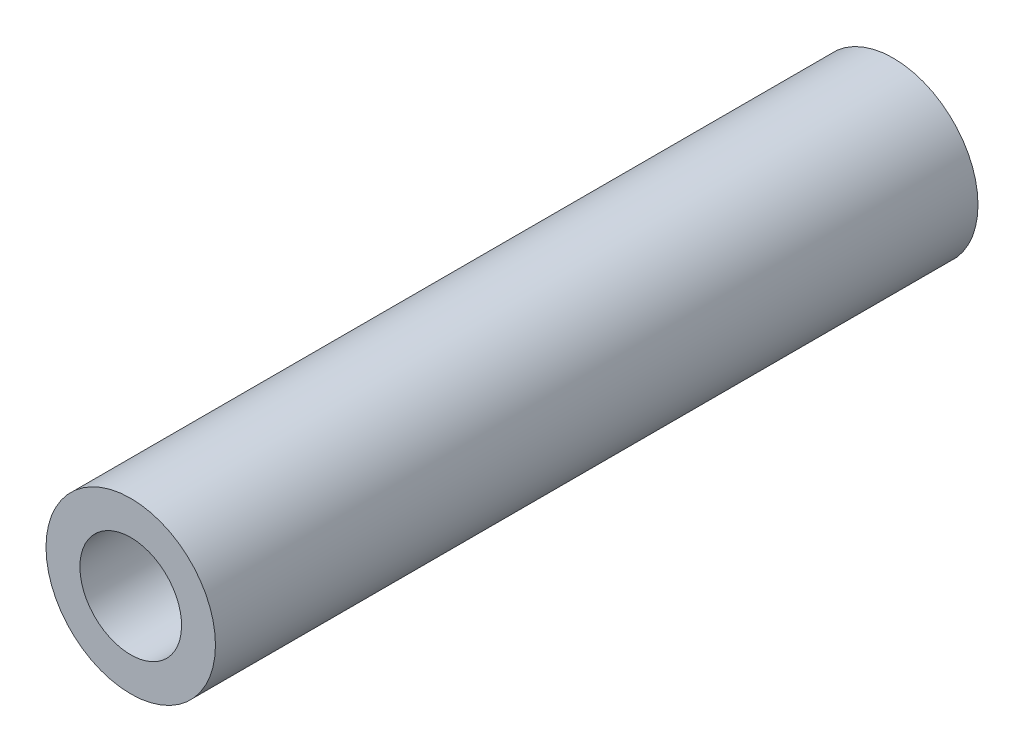
ISO-10303-21;
HEADER;
FILE_DESCRIPTION(('STEP AP214'),'2;1');
FILE_NAME('part.step','',(''),(''),'','','');
FILE_SCHEMA(('AUTOMOTIVE_DESIGN { 1 0 10303 214 1 1 1 1 }'));
ENDSEC;
DATA;
#1=APPLICATION_CONTEXT('core data for automotive mechanical design processes');
#2=APPLICATION_PROTOCOL_DEFINITION('international standard','automotive_design',2000,#1);
#3=PRODUCT_CONTEXT('',#1,'mechanical');
#4=PRODUCT('Part','Part','',(#3));
#5=PRODUCT_RELATED_PRODUCT_CATEGORY('part','',(#4));
#6=PRODUCT_DEFINITION_FORMATION('','',#4);
#7=PRODUCT_DEFINITION_CONTEXT('part definition',#1,'design');
#8=PRODUCT_DEFINITION('design','',#6,#7);
#9=PRODUCT_DEFINITION_SHAPE('','',#8);
#10=(LENGTH_UNIT() NAMED_UNIT(*) SI_UNIT(.MILLI.,.METRE.));
#11=(NAMED_UNIT(*) PLANE_ANGLE_UNIT() SI_UNIT($,.RADIAN.));
#12=(NAMED_UNIT(*) SI_UNIT($,.STERADIAN.) SOLID_ANGLE_UNIT());
#13=UNCERTAINTY_MEASURE_WITH_UNIT(LENGTH_MEASURE(1.E-05),#10,'distance_accuracy_value','');
#14=(GEOMETRIC_REPRESENTATION_CONTEXT(3) GLOBAL_UNCERTAINTY_ASSIGNED_CONTEXT((#13)) GLOBAL_UNIT_ASSIGNED_CONTEXT((#10,
#11,#12)) REPRESENTATION_CONTEXT('',''));
#15=CARTESIAN_POINT('',(0.,0.,0.));
#16=DIRECTION('',(0.,0.,1.));
#17=DIRECTION('',(1.,0.,0.));
#18=AXIS2_PLACEMENT_3D('',#15,#16,#17);
#19=CARTESIAN_POINT('',(0.,0.,-10.));
#20=DIRECTION('',(0.,0.,1.));
#21=DIRECTION('',(0.,-1.,0.));
#22=AXIS2_PLACEMENT_3D('',#19,#20,#21);
#23=PLANE('',#22);
#24=CARTESIAN_POINT('',(0.,0.,-10.));
#25=DIRECTION('',(0.,0.,-1.));
#26=DIRECTION('',(0.,1.,0.));
#27=AXIS2_PLACEMENT_3D('',#24,#25,#26);
#28=CIRCLE('',#27,3.);
#29=CARTESIAN_POINT('',(0.,3.,-10.));
#30=VERTEX_POINT('',#29);
#31=EDGE_CURVE('E10',#30,#30,#28,.T.);
#32=ORIENTED_EDGE('',*,*,#31,.F.);
#33=EDGE_LOOP('',(#32));
#34=FACE_BOUND('',#33,.T.);
#35=ADVANCED_FACE('F31',(#34),#23,.T.);
#36=CARTESIAN_POINT('',(0.,0.,-35.));
#37=DIRECTION('',(0.,0.,-1.));
#38=DIRECTION('',(0.,1.,0.));
#39=AXIS2_PLACEMENT_3D('',#36,#37,#38);
#40=CYLINDRICAL_SURFACE('',#39,3.);
#41=ORIENTED_EDGE('',*,*,#31,.T.);
#42=EDGE_LOOP('',(#41));
#43=FACE_BOUND('',#42,.T.);
#44=CARTESIAN_POINT('',(0.,0.,0.));
#45=DIRECTION('',(0.,0.,-1.));
#46=DIRECTION('',(0.,1.,0.));
#47=AXIS2_PLACEMENT_3D('',#44,#45,#46);
#48=CIRCLE('',#47,3.);
#49=CARTESIAN_POINT('',(0.,3.,0.));
#50=VERTEX_POINT('',#49);
#51=EDGE_CURVE('E37',#50,#50,#48,.T.);
#52=ORIENTED_EDGE('',*,*,#51,.F.);
#53=EDGE_LOOP('',(#52));
#54=FACE_BOUND('',#53,.T.);
#55=ADVANCED_FACE('F73',(#43,#54),#40,.F.);
#56=CARTESIAN_POINT('',(0.,3.,0.));
#57=DIRECTION('',(0.,0.,1.));
#58=DIRECTION('',(0.,-1.,0.));
#59=AXIS2_PLACEMENT_3D('',#56,#57,#58);
#60=PLANE('',#59);
#61=ORIENTED_EDGE('',*,*,#51,.T.);
#62=EDGE_LOOP('',(#61));
#63=FACE_BOUND('',#62,.T.);
#64=CARTESIAN_POINT('',(0.,0.,0.));
#65=DIRECTION('',(0.,0.,-1.));
#66=DIRECTION('',(0.,1.,0.));
#67=AXIS2_PLACEMENT_3D('',#64,#65,#66);
#68=CIRCLE('',#67,5.);
#69=CARTESIAN_POINT('',(0.,4.99999999999999,0.));
#70=VERTEX_POINT('',#69);
#71=EDGE_CURVE('E41',#70,#70,#68,.T.);
#72=ORIENTED_EDGE('',*,*,#71,.F.);
#73=EDGE_LOOP('',(#72));
#74=FACE_BOUND('',#73,.T.);
#75=ADVANCED_FACE('F78',(#63,#74),#60,.T.);
#76=CARTESIAN_POINT('',(0.,0.,-35.));
#77=DIRECTION('',(0.,0.,-1.));
#78=DIRECTION('',(0.,1.,0.));
#79=AXIS2_PLACEMENT_3D('',#76,#77,#78);
#80=CYLINDRICAL_SURFACE('',#79,5.);
#81=ORIENTED_EDGE('',*,*,#71,.T.);
#82=EDGE_LOOP('',(#81));
#83=FACE_BOUND('',#82,.T.);
#84=CARTESIAN_POINT('',(0.,0.,-45.));
#85=DIRECTION('',(0.,0.,-1.));
#86=DIRECTION('',(0.,1.,0.));
#87=AXIS2_PLACEMENT_3D('',#84,#85,#86);
#88=CIRCLE('',#87,4.99999999999999);
#89=CARTESIAN_POINT('',(0.,4.99999999999999,-45.));
#90=VERTEX_POINT('',#89);
#91=EDGE_CURVE('E45',#90,#90,#88,.T.);
#92=ORIENTED_EDGE('',*,*,#91,.F.);
#93=EDGE_LOOP('',(#92));
#94=FACE_BOUND('',#93,.T.);
#95=ADVANCED_FACE('F69',(#83,#94),#80,.T.);
#96=CARTESIAN_POINT('',(0.,4.99999999999999,-45.));
#97=DIRECTION('',(0.,0.,-1.));
#98=DIRECTION('',(0.,1.,0.));
#99=AXIS2_PLACEMENT_3D('',#96,#97,#98);
#100=PLANE('',#99);
#101=ORIENTED_EDGE('',*,*,#91,.T.);
#102=EDGE_LOOP('',(#101));
#103=FACE_BOUND('',#102,.T.);
#104=CARTESIAN_POINT('',(0.,0.,-45.));
#105=DIRECTION('',(0.,0.,-1.));
#106=DIRECTION('',(0.,1.,0.));
#107=AXIS2_PLACEMENT_3D('',#104,#105,#106);
#108=CIRCLE('',#107,3.);
#109=CARTESIAN_POINT('',(0.,3.,-45.));
#110=VERTEX_POINT('',#109);
#111=EDGE_CURVE('E50',#110,#110,#108,.T.);
#112=ORIENTED_EDGE('',*,*,#111,.F.);
#113=EDGE_LOOP('',(#112));
#114=FACE_BOUND('',#113,.T.);
#115=ADVANCED_FACE('F61',(#103,#114),#100,.T.);
#116=CARTESIAN_POINT('',(0.,0.,-35.));
#117=DIRECTION('',(0.,0.,-1.));
#118=DIRECTION('',(0.,1.,0.));
#119=AXIS2_PLACEMENT_3D('',#116,#117,#118);
#120=CYLINDRICAL_SURFACE('',#119,3.);
#121=ORIENTED_EDGE('',*,*,#111,.T.);
#122=EDGE_LOOP('',(#121));
#123=FACE_BOUND('',#122,.T.);
#124=CARTESIAN_POINT('',(0.,0.,-35.));
#125=DIRECTION('',(0.,0.,-1.));
#126=DIRECTION('',(0.,1.,0.));
#127=AXIS2_PLACEMENT_3D('',#124,#125,#126);
#128=CIRCLE('',#127,3.);
#129=CARTESIAN_POINT('',(0.,3.,-35.));
#130=VERTEX_POINT('',#129);
#131=EDGE_CURVE('E53',#130,#130,#128,.T.);
#132=ORIENTED_EDGE('',*,*,#131,.F.);
#133=EDGE_LOOP('',(#132));
#134=FACE_BOUND('',#133,.T.);
#135=ADVANCED_FACE('F59',(#123,#134),#120,.F.);
#136=CARTESIAN_POINT('',(0.,3.,-35.));
#137=DIRECTION('',(0.,0.,-1.));
#138=DIRECTION('',(0.,1.,0.));
#139=AXIS2_PLACEMENT_3D('',#136,#137,#138);
#140=PLANE('',#139);
#141=ORIENTED_EDGE('',*,*,#131,.T.);
#142=EDGE_LOOP('',(#141));
#143=FACE_BOUND('',#142,.T.);
#144=ADVANCED_FACE('F57',(#143),#140,.T.);
#145=CLOSED_SHELL('',(#35,#55,#75,#95,#115,#135,#144));
#146=MANIFOLD_SOLID_BREP('B2',#145);
#147=ADVANCED_BREP_SHAPE_REPRESENTATION('',(#18,#146),#14);
#148=SHAPE_DEFINITION_REPRESENTATION(#9,#147);
ENDSEC;
END-ISO-10303-21;
